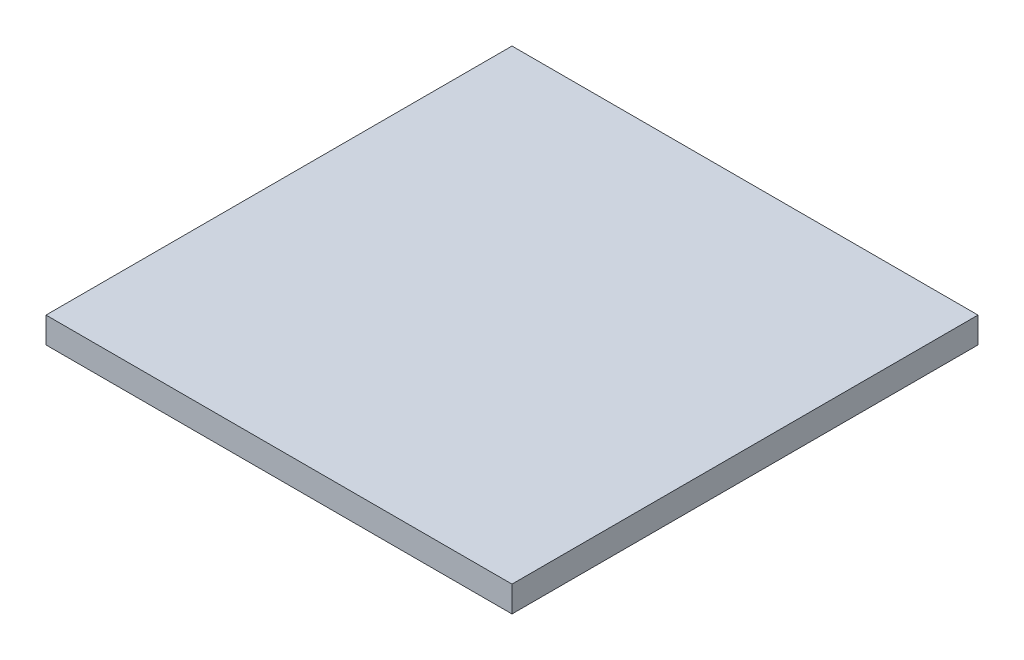
ISO-10303-21;
HEADER;
FILE_DESCRIPTION(('STEP AP214'),'2;1');
FILE_NAME('part.step','',(''),(''),'','','');
FILE_SCHEMA(('AUTOMOTIVE_DESIGN { 1 0 10303 214 1 1 1 1 }'));
ENDSEC;
DATA;
#1=APPLICATION_CONTEXT('core data for automotive mechanical design processes');
#2=APPLICATION_PROTOCOL_DEFINITION('international standard','automotive_design',2000,#1);
#3=PRODUCT_CONTEXT('',#1,'mechanical');
#4=PRODUCT('Part','Part','',(#3));
#5=PRODUCT_RELATED_PRODUCT_CATEGORY('part','',(#4));
#6=PRODUCT_DEFINITION_FORMATION('','',#4);
#7=PRODUCT_DEFINITION_CONTEXT('part definition',#1,'design');
#8=PRODUCT_DEFINITION('design','',#6,#7);
#9=PRODUCT_DEFINITION_SHAPE('','',#8);
#10=(LENGTH_UNIT() NAMED_UNIT(*) SI_UNIT(.MILLI.,.METRE.));
#11=(NAMED_UNIT(*) PLANE_ANGLE_UNIT() SI_UNIT($,.RADIAN.));
#12=(NAMED_UNIT(*) SI_UNIT($,.STERADIAN.) SOLID_ANGLE_UNIT());
#13=UNCERTAINTY_MEASURE_WITH_UNIT(LENGTH_MEASURE(1.E-05),#10,'distance_accuracy_value','');
#14=(GEOMETRIC_REPRESENTATION_CONTEXT(3) GLOBAL_UNCERTAINTY_ASSIGNED_CONTEXT((#13)) GLOBAL_UNIT_ASSIGNED_CONTEXT((#10,
#11,#12)) REPRESENTATION_CONTEXT('',''));
#15=CARTESIAN_POINT('',(0.,0.,0.));
#16=DIRECTION('',(0.,0.,1.));
#17=DIRECTION('',(1.,0.,0.));
#18=AXIS2_PLACEMENT_3D('',#15,#16,#17);
#19=CARTESIAN_POINT('',(-3.15,0.35,-3.15));
#20=DIRECTION('',(1.,0.,0.));
#21=DIRECTION('',(0.,0.,-1.));
#22=AXIS2_PLACEMENT_3D('',#19,#20,#21);
#23=PLANE('',#22);
#24=DIRECTION('',(0.,0.,1.));
#25=VECTOR('',#24,1.);
#26=CARTESIAN_POINT('',(-3.15,0.,-3.15));
#27=LINE('',#26,#25);
#28=CARTESIAN_POINT('',(-3.15,0.,-3.15));
#29=VERTEX_POINT('',#28);
#30=CARTESIAN_POINT('',(-3.15,0.,3.15));
#31=VERTEX_POINT('',#30);
#32=EDGE_CURVE('E114',#29,#31,#27,.T.);
#33=ORIENTED_EDGE('',*,*,#32,.T.);
#34=DIRECTION('',(0.,-1.,0.));
#35=VECTOR('',#34,1.);
#36=CARTESIAN_POINT('',(-3.15,0.35,3.15));
#37=LINE('',#36,#35);
#38=CARTESIAN_POINT('',(-3.15,0.35,3.15));
#39=VERTEX_POINT('',#38);
#40=EDGE_CURVE('E11',#39,#31,#37,.T.);
#41=ORIENTED_EDGE('',*,*,#40,.F.);
#42=DIRECTION('',(0.,0.,1.));
#43=VECTOR('',#42,1.);
#44=CARTESIAN_POINT('',(-3.15,0.35,-3.15));
#45=LINE('',#44,#43);
#46=CARTESIAN_POINT('',(-3.15,0.35,-3.15));
#47=VERTEX_POINT('',#46);
#48=EDGE_CURVE('E96',#47,#39,#45,.T.);
#49=ORIENTED_EDGE('',*,*,#48,.F.);
#50=DIRECTION('',(0.,-1.,0.));
#51=VECTOR('',#50,1.);
#52=CARTESIAN_POINT('',(-3.15,0.35,-3.15));
#53=LINE('',#52,#51);
#54=EDGE_CURVE('E110',#47,#29,#53,.T.);
#55=ORIENTED_EDGE('',*,*,#54,.T.);
#56=EDGE_LOOP('',(#33,#41,#49,#55));
#57=FACE_BOUND('',#56,.T.);
#58=ADVANCED_FACE('F44',(#57),#23,.F.);
#59=CARTESIAN_POINT('',(-3.15,0.35,3.15));
#60=DIRECTION('',(0.,0.,-1.));
#61=DIRECTION('',(-1.,0.,0.));
#62=AXIS2_PLACEMENT_3D('',#59,#60,#61);
#63=PLANE('',#62);
#64=DIRECTION('',(1.,0.,0.));
#65=VECTOR('',#64,1.);
#66=CARTESIAN_POINT('',(-3.15,0.,3.15));
#67=LINE('',#66,#65);
#68=CARTESIAN_POINT('',(3.15,0.,3.15));
#69=VERTEX_POINT('',#68);
#70=EDGE_CURVE('E101',#31,#69,#67,.T.);
#71=ORIENTED_EDGE('',*,*,#70,.T.);
#72=DIRECTION('',(0.,-1.,0.));
#73=VECTOR('',#72,1.);
#74=CARTESIAN_POINT('',(3.15,0.35,3.15));
#75=LINE('',#74,#73);
#76=CARTESIAN_POINT('',(3.15,0.35,3.15));
#77=VERTEX_POINT('',#76);
#78=EDGE_CURVE('E53',#77,#69,#75,.T.);
#79=ORIENTED_EDGE('',*,*,#78,.F.);
#80=DIRECTION('',(1.,0.,0.));
#81=VECTOR('',#80,1.);
#82=CARTESIAN_POINT('',(-3.15,0.35,3.15));
#83=LINE('',#82,#81);
#84=EDGE_CURVE('E91',#39,#77,#83,.T.);
#85=ORIENTED_EDGE('',*,*,#84,.F.);
#86=ORIENTED_EDGE('',*,*,#40,.T.);
#87=EDGE_LOOP('',(#71,#79,#85,#86));
#88=FACE_BOUND('',#87,.T.);
#89=ADVANCED_FACE('F100',(#88),#63,.F.);
#90=CARTESIAN_POINT('',(3.15,0.35,-3.15));
#91=DIRECTION('',(-1.,0.,0.));
#92=DIRECTION('',(0.,0.,1.));
#93=AXIS2_PLACEMENT_3D('',#90,#91,#92);
#94=PLANE('',#93);
#95=DIRECTION('',(0.,0.,-1.));
#96=VECTOR('',#95,1.);
#97=CARTESIAN_POINT('',(3.15,0.,-3.15));
#98=LINE('',#97,#96);
#99=CARTESIAN_POINT('',(3.15,0.,-3.15));
#100=VERTEX_POINT('',#99);
#101=EDGE_CURVE('E78',#69,#100,#98,.T.);
#102=ORIENTED_EDGE('',*,*,#101,.T.);
#103=DIRECTION('',(0.,-1.,0.));
#104=VECTOR('',#103,1.);
#105=CARTESIAN_POINT('',(3.15,0.35,-3.15));
#106=LINE('',#105,#104);
#107=CARTESIAN_POINT('',(3.15,0.35,-3.15));
#108=VERTEX_POINT('',#107);
#109=EDGE_CURVE('E103',#108,#100,#106,.T.);
#110=ORIENTED_EDGE('',*,*,#109,.F.);
#111=DIRECTION('',(0.,0.,-1.));
#112=VECTOR('',#111,1.);
#113=CARTESIAN_POINT('',(3.15,0.35,-3.15));
#114=LINE('',#113,#112);
#115=EDGE_CURVE('E94',#77,#108,#114,.T.);
#116=ORIENTED_EDGE('',*,*,#115,.F.);
#117=ORIENTED_EDGE('',*,*,#78,.T.);
#118=EDGE_LOOP('',(#102,#110,#116,#117));
#119=FACE_BOUND('',#118,.T.);
#120=ADVANCED_FACE('F104',(#119),#94,.F.);
#121=CARTESIAN_POINT('',(-3.15,0.35,-3.15));
#122=DIRECTION('',(0.,0.,1.));
#123=DIRECTION('',(1.,0.,0.));
#124=AXIS2_PLACEMENT_3D('',#121,#122,#123);
#125=PLANE('',#124);
#126=DIRECTION('',(-1.,0.,0.));
#127=VECTOR('',#126,1.);
#128=CARTESIAN_POINT('',(-3.15,0.,-3.15));
#129=LINE('',#128,#127);
#130=EDGE_CURVE('E84',#100,#29,#129,.T.);
#131=ORIENTED_EDGE('',*,*,#130,.T.);
#132=ORIENTED_EDGE('',*,*,#54,.F.);
#133=DIRECTION('',(-1.,0.,0.));
#134=VECTOR('',#133,1.);
#135=CARTESIAN_POINT('',(-3.15,0.35,-3.15));
#136=LINE('',#135,#134);
#137=EDGE_CURVE('E61',#108,#47,#136,.T.);
#138=ORIENTED_EDGE('',*,*,#137,.F.);
#139=ORIENTED_EDGE('',*,*,#109,.T.);
#140=EDGE_LOOP('',(#131,#132,#138,#139));
#141=FACE_BOUND('',#140,.T.);
#142=ADVANCED_FACE('F129',(#141),#125,.F.);
#143=CARTESIAN_POINT('',(0.,0.35,0.));
#144=DIRECTION('',(0.,1.,0.));
#145=DIRECTION('',(0.,0.,1.));
#146=AXIS2_PLACEMENT_3D('',#143,#144,#145);
#147=PLANE('',#146);
#148=ORIENTED_EDGE('',*,*,#48,.T.);
#149=ORIENTED_EDGE('',*,*,#84,.T.);
#150=ORIENTED_EDGE('',*,*,#115,.T.);
#151=ORIENTED_EDGE('',*,*,#137,.T.);
#152=EDGE_LOOP('',(#148,#149,#150,#151));
#153=FACE_BOUND('',#152,.T.);
#154=ADVANCED_FACE('F92',(#153),#147,.T.);
#155=CARTESIAN_POINT('',(0.,0.,0.));
#156=DIRECTION('',(0.,1.,0.));
#157=DIRECTION('',(0.,0.,1.));
#158=AXIS2_PLACEMENT_3D('',#155,#156,#157);
#159=PLANE('',#158);
#160=ORIENTED_EDGE('',*,*,#32,.F.);
#161=ORIENTED_EDGE('',*,*,#130,.F.);
#162=ORIENTED_EDGE('',*,*,#101,.F.);
#163=ORIENTED_EDGE('',*,*,#70,.F.);
#164=EDGE_LOOP('',(#160,#161,#162,#163));
#165=FACE_BOUND('',#164,.T.);
#166=ADVANCED_FACE('F132',(#165),#159,.F.);
#167=CLOSED_SHELL('',(#58,#89,#120,#142,#154,#166));
#168=MANIFOLD_SOLID_BREP('B2',#167);
#169=ADVANCED_BREP_SHAPE_REPRESENTATION('',(#18,#168),#14);
#170=SHAPE_DEFINITION_REPRESENTATION(#9,#169);
ENDSEC;
END-ISO-10303-21;
